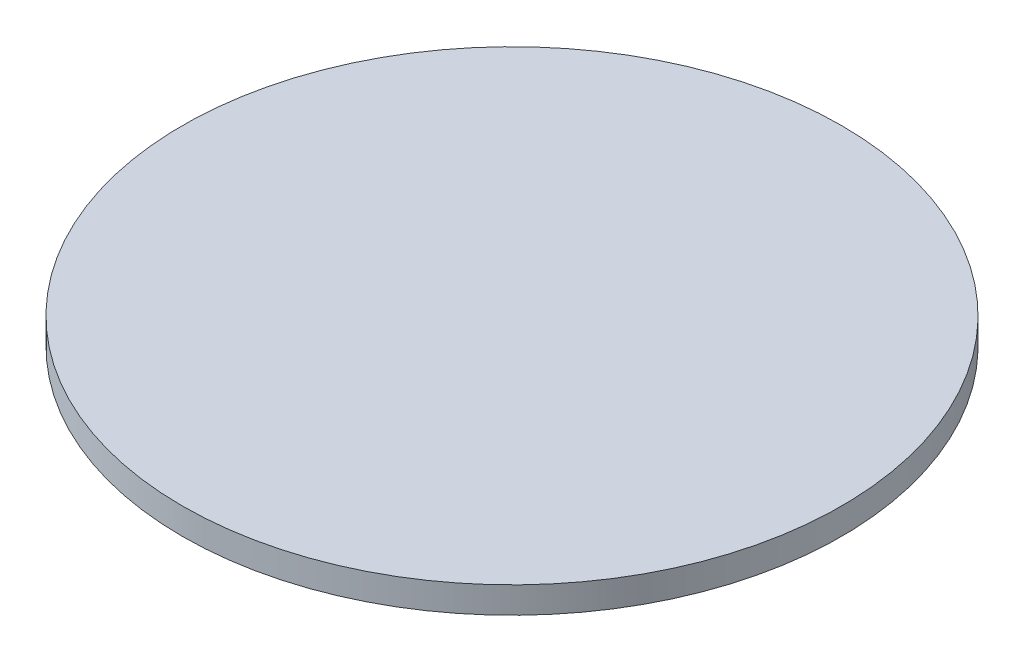
ISO-10303-21;
HEADER;
FILE_DESCRIPTION(('STEP AP214'),'2;1');
FILE_NAME('part.step','',(''),(''),'','','');
FILE_SCHEMA(('AUTOMOTIVE_DESIGN { 1 0 10303 214 1 1 1 1 }'));
ENDSEC;
DATA;
#1=APPLICATION_CONTEXT('core data for automotive mechanical design processes');
#2=APPLICATION_PROTOCOL_DEFINITION('international standard','automotive_design',2000,#1);
#3=PRODUCT_CONTEXT('',#1,'mechanical');
#4=PRODUCT('Part','Part','',(#3));
#5=PRODUCT_RELATED_PRODUCT_CATEGORY('part','',(#4));
#6=PRODUCT_DEFINITION_FORMATION('','',#4);
#7=PRODUCT_DEFINITION_CONTEXT('part definition',#1,'design');
#8=PRODUCT_DEFINITION('design','',#6,#7);
#9=PRODUCT_DEFINITION_SHAPE('','',#8);
#10=(LENGTH_UNIT() NAMED_UNIT(*) SI_UNIT(.MILLI.,.METRE.));
#11=(NAMED_UNIT(*) PLANE_ANGLE_UNIT() SI_UNIT($,.RADIAN.));
#12=(NAMED_UNIT(*) SI_UNIT($,.STERADIAN.) SOLID_ANGLE_UNIT());
#13=UNCERTAINTY_MEASURE_WITH_UNIT(LENGTH_MEASURE(1.E-05),#10,'distance_accuracy_value','');
#14=(GEOMETRIC_REPRESENTATION_CONTEXT(3) GLOBAL_UNCERTAINTY_ASSIGNED_CONTEXT((#13)) GLOBAL_UNIT_ASSIGNED_CONTEXT((#10,
#11,#12)) REPRESENTATION_CONTEXT('',''));
#15=CARTESIAN_POINT('',(0.,0.,0.));
#16=DIRECTION('',(0.,0.,1.));
#17=DIRECTION('',(1.,0.,0.));
#18=AXIS2_PLACEMENT_3D('',#15,#16,#17);
#19=CARTESIAN_POINT('',(0.,2.,0.));
#20=DIRECTION('',(0.,-1.,0.));
#21=DIRECTION('',(0.,0.,-1.));
#22=AXIS2_PLACEMENT_3D('',#19,#20,#21);
#23=CYLINDRICAL_SURFACE('',#22,25.);
#24=CARTESIAN_POINT('',(0.,2.,0.));
#25=DIRECTION('',(0.,1.,0.));
#26=DIRECTION('',(0.,0.,1.));
#27=AXIS2_PLACEMENT_3D('',#24,#25,#26);
#28=CIRCLE('',#27,25.);
#29=CARTESIAN_POINT('',(0.,2.,25.));
#30=VERTEX_POINT('',#29);
#31=EDGE_CURVE('E10',#30,#30,#28,.T.);
#32=ORIENTED_EDGE('',*,*,#31,.F.);
#33=EDGE_LOOP('',(#32));
#34=FACE_BOUND('',#33,.T.);
#35=CARTESIAN_POINT('',(0.,0.,0.));
#36=DIRECTION('',(0.,1.,0.));
#37=DIRECTION('',(0.,0.,1.));
#38=AXIS2_PLACEMENT_3D('',#35,#36,#37);
#39=CIRCLE('',#38,25.);
#40=CARTESIAN_POINT('',(0.,0.,25.));
#41=VERTEX_POINT('',#40);
#42=EDGE_CURVE('E36',#41,#41,#39,.T.);
#43=ORIENTED_EDGE('',*,*,#42,.T.);
#44=EDGE_LOOP('',(#43));
#45=FACE_BOUND('',#44,.T.);
#46=ADVANCED_FACE('F33',(#34,#45),#23,.T.);
#47=CARTESIAN_POINT('',(0.,2.,0.));
#48=DIRECTION('',(0.,1.,0.));
#49=DIRECTION('',(0.,0.,1.));
#50=AXIS2_PLACEMENT_3D('',#47,#48,#49);
#51=PLANE('',#50);
#52=ORIENTED_EDGE('',*,*,#31,.T.);
#53=EDGE_LOOP('',(#52));
#54=FACE_BOUND('',#53,.T.);
#55=ADVANCED_FACE('F48',(#54),#51,.T.);
#56=CARTESIAN_POINT('',(0.,0.,0.));
#57=DIRECTION('',(0.,1.,0.));
#58=DIRECTION('',(0.,0.,1.));
#59=AXIS2_PLACEMENT_3D('',#56,#57,#58);
#60=PLANE('',#59);
#61=ORIENTED_EDGE('',*,*,#42,.F.);
#62=EDGE_LOOP('',(#61));
#63=FACE_BOUND('',#62,.T.);
#64=ADVANCED_FACE('F46',(#63),#60,.F.);
#65=CLOSED_SHELL('',(#46,#55,#64));
#66=MANIFOLD_SOLID_BREP('B2',#65);
#67=ADVANCED_BREP_SHAPE_REPRESENTATION('',(#18,#66),#14);
#68=SHAPE_DEFINITION_REPRESENTATION(#9,#67);
ENDSEC;
END-ISO-10303-21;
